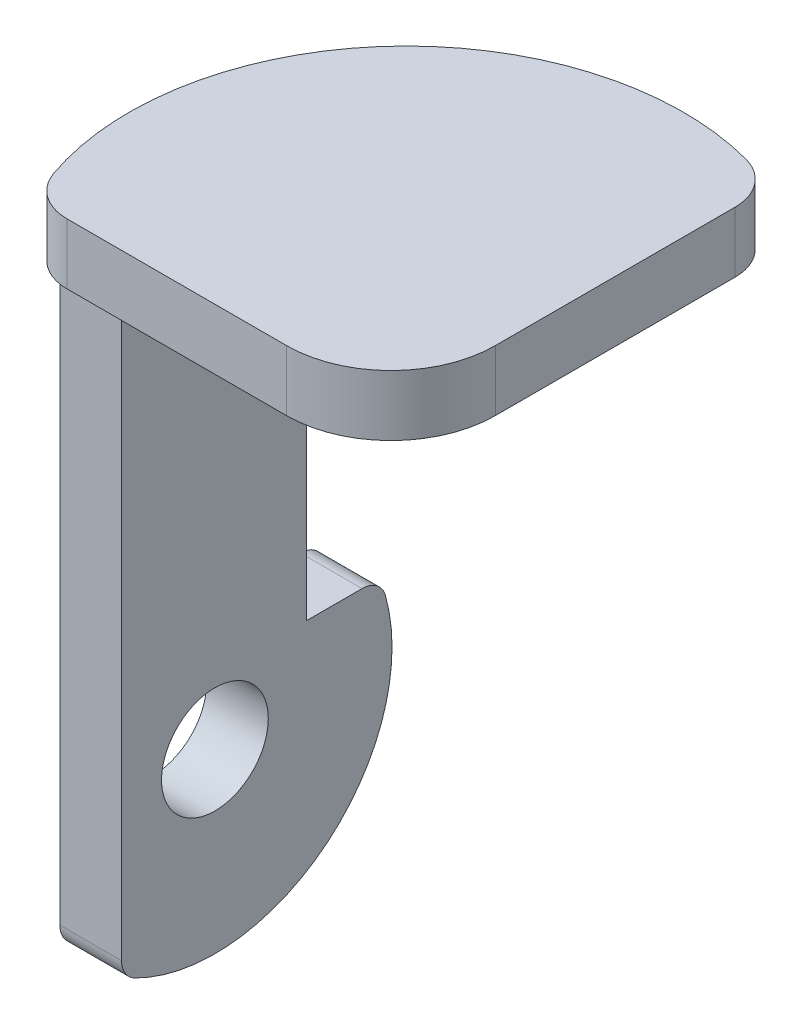
ISO-10303-21;
HEADER;
FILE_DESCRIPTION(('STEP AP214'),'2;1');
FILE_NAME('part.step','',(''),(''),'','','');
FILE_SCHEMA(('AUTOMOTIVE_DESIGN { 1 0 10303 214 1 1 1 1 }'));
ENDSEC;
DATA;
#1=APPLICATION_CONTEXT('core data for automotive mechanical design processes');
#2=APPLICATION_PROTOCOL_DEFINITION('international standard','automotive_design',2000,#1);
#3=PRODUCT_CONTEXT('',#1,'mechanical');
#4=PRODUCT('Part','Part','',(#3));
#5=PRODUCT_RELATED_PRODUCT_CATEGORY('part','',(#4));
#6=PRODUCT_DEFINITION_FORMATION('','',#4);
#7=PRODUCT_DEFINITION_CONTEXT('part definition',#1,'design');
#8=PRODUCT_DEFINITION('design','',#6,#7);
#9=PRODUCT_DEFINITION_SHAPE('','',#8);
#10=(LENGTH_UNIT() NAMED_UNIT(*) SI_UNIT(.MILLI.,.METRE.));
#11=(NAMED_UNIT(*) PLANE_ANGLE_UNIT() SI_UNIT($,.RADIAN.));
#12=(NAMED_UNIT(*) SI_UNIT($,.STERADIAN.) SOLID_ANGLE_UNIT());
#13=UNCERTAINTY_MEASURE_WITH_UNIT(LENGTH_MEASURE(1.E-05),#10,'distance_accuracy_value','');
#14=(GEOMETRIC_REPRESENTATION_CONTEXT(3) GLOBAL_UNCERTAINTY_ASSIGNED_CONTEXT((#13)) GLOBAL_UNIT_ASSIGNED_CONTEXT((#10,
#11,#12)) REPRESENTATION_CONTEXT('',''));
#15=CARTESIAN_POINT('',(0.,0.,0.));
#16=DIRECTION('',(0.,0.,1.));
#17=DIRECTION('',(1.,0.,0.));
#18=AXIS2_PLACEMENT_3D('',#15,#16,#17);
#19=CARTESIAN_POINT('',(-84.6,-198.317993617898,-38.0485313560635));
#20=DIRECTION('',(1.,0.,0.));
#21=DIRECTION('',(0.,0.,-1.));
#22=AXIS2_PLACEMENT_3D('',#19,#20,#21);
#23=PLANE('',#22);
#24=DIRECTION('',(0.,-1.,0.));
#25=VECTOR('',#24,1.);
#26=CARTESIAN_POINT('',(-84.6,-215.369552032089,61.1));
#27=LINE('',#26,#25);
#28=CARTESIAN_POINT('',(-84.6,-25.3695520320889,61.1));
#29=VERTEX_POINT('',#28);
#30=CARTESIAN_POINT('',(-84.6,-271.554514433073,61.1));
#31=VERTEX_POINT('',#30);
#32=EDGE_CURVE('E98',#29,#31,#27,.T.);
#33=ORIENTED_EDGE('',*,*,#32,.T.);
#34=CARTESIAN_POINT('',(-84.6,-271.554514433073,51.1));
#35=DIRECTION('',(1.,0.,0.));
#36=DIRECTION('',(0.,0.,1.));
#37=AXIS2_PLACEMENT_3D('',#34,#35,#36);
#38=CIRCLE('',#37,9.99999999999999);
#39=CARTESIAN_POINT('',(-84.6,-280.472762433229,55.6238095238095));
#40=VERTEX_POINT('',#39);
#41=EDGE_CURVE('E166',#31,#40,#38,.T.);
#42=ORIENTED_EDGE('',*,*,#41,.T.);
#43=CARTESIAN_POINT('',(-84.6,-215.369552032089,22.6));
#44=DIRECTION('',(1.,0.,0.));
#45=DIRECTION('',(0.,0.,-1.));
#46=AXIS2_PLACEMENT_3D('',#43,#44,#45);
#47=CIRCLE('',#46,73.);
#48=CARTESIAN_POINT('',(-84.6,-195.611397044217,-47.6752823649625));
#49=VERTEX_POINT('',#48);
#50=EDGE_CURVE('E158',#40,#49,#47,.T.);
#51=ORIENTED_EDGE('',*,*,#50,.T.);
#52=CARTESIAN_POINT('',(-84.6,-198.317993617898,-38.0485313560635));
#53=DIRECTION('',(1.,0.,0.));
#54=DIRECTION('',(0.,0.,-1.));
#55=AXIS2_PLACEMENT_3D('',#52,#53,#54);
#56=CIRCLE('',#55,9.99999999999999);
#57=CARTESIAN_POINT('',(-84.6,-188.317993617898,-38.0485313560635));
#58=VERTEX_POINT('',#57);
#59=EDGE_CURVE('E115',#49,#58,#56,.T.);
#60=ORIENTED_EDGE('',*,*,#59,.T.);
#61=DIRECTION('',(0.,0.,1.));
#62=VECTOR('',#61,1.);
#63=CARTESIAN_POINT('',(-84.6,-188.317993617898,-15.1));
#64=LINE('',#63,#62);
#65=CARTESIAN_POINT('',(-84.6,-188.317993617898,-15.1));
#66=VERTEX_POINT('',#65);
#67=EDGE_CURVE('E109',#58,#66,#64,.T.);
#68=ORIENTED_EDGE('',*,*,#67,.T.);
#69=DIRECTION('',(0.,1.,0.));
#70=VECTOR('',#69,1.);
#71=CARTESIAN_POINT('',(-84.6,-188.317993617898,-15.1));
#72=LINE('',#71,#70);
#73=CARTESIAN_POINT('',(-84.6,-25.3695520320889,-15.1));
#74=VERTEX_POINT('',#73);
#75=EDGE_CURVE('E113',#66,#74,#72,.T.);
#76=ORIENTED_EDGE('',*,*,#75,.T.);
#77=DIRECTION('',(0.,0.,1.));
#78=VECTOR('',#77,1.);
#79=CARTESIAN_POINT('',(-84.6,-25.3695520320889,-15.1));
#80=LINE('',#79,#78);
#81=EDGE_CURVE('E59',#74,#29,#80,.T.);
#82=ORIENTED_EDGE('',*,*,#81,.T.);
#83=EDGE_LOOP('',(#33,#42,#51,#60,#68,#76,#82));
#84=FACE_BOUND('',#83,.T.);
#85=CARTESIAN_POINT('',(-84.6,-215.369552032089,22.6));
#86=DIRECTION('',(1.,0.,0.));
#87=DIRECTION('',(0.,0.,-1.));
#88=AXIS2_PLACEMENT_3D('',#85,#86,#87);
#89=CIRCLE('',#88,22.);
#90=CARTESIAN_POINT('',(-84.6,-215.369552032089,0.600000000000024));
#91=VERTEX_POINT('',#90);
#92=EDGE_CURVE('E135',#91,#91,#89,.T.);
#93=ORIENTED_EDGE('',*,*,#92,.F.);
#94=EDGE_LOOP('',(#93));
#95=FACE_BOUND('',#94,.T.);
#96=ADVANCED_FACE('F42',(#84,#95),#23,.T.);
#97=CARTESIAN_POINT('',(-110.,-198.317993617898,-38.0485313560635));
#98=DIRECTION('',(1.,0.,0.));
#99=DIRECTION('',(0.,0.,-1.));
#100=AXIS2_PLACEMENT_3D('',#97,#98,#99);
#101=PLANE('',#100);
#102=DIRECTION('',(0.,-1.,0.));
#103=VECTOR('',#102,1.);
#104=CARTESIAN_POINT('',(-110.,-215.369552032089,61.1));
#105=LINE('',#104,#103);
#106=CARTESIAN_POINT('',(-110.,-25.3695520320889,61.1));
#107=VERTEX_POINT('',#106);
#108=CARTESIAN_POINT('',(-110.,-271.554514433073,61.1));
#109=VERTEX_POINT('',#108);
#110=EDGE_CURVE('E92',#107,#109,#105,.T.);
#111=ORIENTED_EDGE('',*,*,#110,.F.);
#112=DIRECTION('',(0.,0.,1.));
#113=VECTOR('',#112,1.);
#114=CARTESIAN_POINT('',(-110.,-25.3695520320889,-15.1));
#115=LINE('',#114,#113);
#116=CARTESIAN_POINT('',(-110.,-25.3695520320889,-15.1));
#117=VERTEX_POINT('',#116);
#118=EDGE_CURVE('E143',#117,#107,#115,.T.);
#119=ORIENTED_EDGE('',*,*,#118,.F.);
#120=DIRECTION('',(0.,1.,0.));
#121=VECTOR('',#120,1.);
#122=CARTESIAN_POINT('',(-110.,-188.317993617898,-15.1));
#123=LINE('',#122,#121);
#124=CARTESIAN_POINT('',(-110.,-188.317993617898,-15.1));
#125=VERTEX_POINT('',#124);
#126=EDGE_CURVE('E85',#125,#117,#123,.T.);
#127=ORIENTED_EDGE('',*,*,#126,.F.);
#128=DIRECTION('',(0.,0.,1.));
#129=VECTOR('',#128,1.);
#130=CARTESIAN_POINT('',(-110.,-188.317993617898,-15.1));
#131=LINE('',#130,#129);
#132=CARTESIAN_POINT('',(-110.,-188.317993617898,-38.0485313560635));
#133=VERTEX_POINT('',#132);
#134=EDGE_CURVE('E123',#133,#125,#131,.T.);
#135=ORIENTED_EDGE('',*,*,#134,.F.);
#136=CARTESIAN_POINT('',(-110.,-198.317993617898,-38.0485313560635));
#137=DIRECTION('',(1.,0.,0.));
#138=DIRECTION('',(0.,0.,-1.));
#139=AXIS2_PLACEMENT_3D('',#136,#137,#138);
#140=CIRCLE('',#139,9.99999999999999);
#141=CARTESIAN_POINT('',(-110.,-195.611397044217,-47.6752823649625));
#142=VERTEX_POINT('',#141);
#143=EDGE_CURVE('E139',#142,#133,#140,.T.);
#144=ORIENTED_EDGE('',*,*,#143,.F.);
#145=CARTESIAN_POINT('',(-110.,-215.369552032089,22.6));
#146=DIRECTION('',(1.,0.,0.));
#147=DIRECTION('',(0.,0.,-1.));
#148=AXIS2_PLACEMENT_3D('',#145,#146,#147);
#149=CIRCLE('',#148,73.);
#150=CARTESIAN_POINT('',(-110.,-280.472762433229,55.6238095238095));
#151=VERTEX_POINT('',#150);
#152=EDGE_CURVE('E137',#151,#142,#149,.T.);
#153=ORIENTED_EDGE('',*,*,#152,.F.);
#154=CARTESIAN_POINT('',(-110.,-271.554514433073,51.1));
#155=DIRECTION('',(1.,0.,0.));
#156=DIRECTION('',(0.,0.,1.));
#157=AXIS2_PLACEMENT_3D('',#154,#155,#156);
#158=CIRCLE('',#157,9.99999999999999);
#159=EDGE_CURVE('E134',#109,#151,#158,.T.);
#160=ORIENTED_EDGE('',*,*,#159,.F.);
#161=EDGE_LOOP('',(#111,#119,#127,#135,#144,#153,#160));
#162=FACE_BOUND('',#161,.T.);
#163=CARTESIAN_POINT('',(-110.,-215.369552032089,22.6));
#164=DIRECTION('',(1.,0.,0.));
#165=DIRECTION('',(0.,0.,-1.));
#166=AXIS2_PLACEMENT_3D('',#163,#164,#165);
#167=CIRCLE('',#166,22.);
#168=CARTESIAN_POINT('',(-110.,-215.369552032089,0.600000000000024));
#169=VERTEX_POINT('',#168);
#170=EDGE_CURVE('E171',#169,#169,#167,.T.);
#171=ORIENTED_EDGE('',*,*,#170,.T.);
#172=EDGE_LOOP('',(#171));
#173=FACE_BOUND('',#172,.T.);
#174=ADVANCED_FACE('F162',(#162,#173),#101,.F.);
#175=CARTESIAN_POINT('',(-84.6,-215.369552032089,61.1));
#176=DIRECTION('',(0.,0.,-1.));
#177=DIRECTION('',(-1.,0.,0.));
#178=AXIS2_PLACEMENT_3D('',#175,#176,#177);
#179=PLANE('',#178);
#180=ORIENTED_EDGE('',*,*,#110,.T.);
#181=DIRECTION('',(-1.,0.,0.));
#182=VECTOR('',#181,1.);
#183=CARTESIAN_POINT('',(-84.6,-271.554514433073,61.1));
#184=LINE('',#183,#182);
#185=EDGE_CURVE('E12',#31,#109,#184,.T.);
#186=ORIENTED_EDGE('',*,*,#185,.F.);
#187=ORIENTED_EDGE('',*,*,#32,.F.);
#188=DIRECTION('',(-1.,0.,0.));
#189=VECTOR('',#188,1.);
#190=CARTESIAN_POINT('',(-84.6,-25.3695520320889,61.1));
#191=LINE('',#190,#189);
#192=EDGE_CURVE('E129',#29,#107,#191,.T.);
#193=ORIENTED_EDGE('',*,*,#192,.T.);
#194=EDGE_LOOP('',(#180,#186,#187,#193));
#195=FACE_BOUND('',#194,.T.);
#196=ADVANCED_FACE('F44',(#195),#179,.F.);
#197=CARTESIAN_POINT('',(-84.6,-271.554514433073,51.1));
#198=DIRECTION('',(-1.,0.,0.));
#199=DIRECTION('',(0.,0.,1.));
#200=AXIS2_PLACEMENT_3D('',#197,#198,#199);
#201=CYLINDRICAL_SURFACE('',#200,9.99999999999999);
#202=ORIENTED_EDGE('',*,*,#159,.T.);
#203=DIRECTION('',(-1.,0.,0.));
#204=VECTOR('',#203,1.);
#205=CARTESIAN_POINT('',(-84.6,-280.472762433229,55.6238095238095));
#206=LINE('',#205,#204);
#207=EDGE_CURVE('E51',#40,#151,#206,.T.);
#208=ORIENTED_EDGE('',*,*,#207,.F.);
#209=ORIENTED_EDGE('',*,*,#41,.F.);
#210=ORIENTED_EDGE('',*,*,#185,.T.);
#211=EDGE_LOOP('',(#202,#208,#209,#210));
#212=FACE_BOUND('',#211,.T.);
#213=ADVANCED_FACE('F198',(#212),#201,.T.);
#214=CARTESIAN_POINT('',(-84.6,-215.369552032089,22.6));
#215=DIRECTION('',(-1.,0.,0.));
#216=DIRECTION('',(0.,0.,1.));
#217=AXIS2_PLACEMENT_3D('',#214,#215,#216);
#218=CYLINDRICAL_SURFACE('',#217,73.);
#219=ORIENTED_EDGE('',*,*,#152,.T.);
#220=DIRECTION('',(-1.,0.,0.));
#221=VECTOR('',#220,1.);
#222=CARTESIAN_POINT('',(-84.6,-195.611397044217,-47.6752823649625));
#223=LINE('',#222,#221);
#224=EDGE_CURVE('E149',#49,#142,#223,.T.);
#225=ORIENTED_EDGE('',*,*,#224,.F.);
#226=ORIENTED_EDGE('',*,*,#50,.F.);
#227=ORIENTED_EDGE('',*,*,#207,.T.);
#228=EDGE_LOOP('',(#219,#225,#226,#227));
#229=FACE_BOUND('',#228,.T.);
#230=ADVANCED_FACE('F156',(#229),#218,.T.);
#231=CARTESIAN_POINT('',(-84.6,-198.317993617898,-38.0485313560635));
#232=DIRECTION('',(-1.,0.,0.));
#233=DIRECTION('',(0.,0.,1.));
#234=AXIS2_PLACEMENT_3D('',#231,#232,#233);
#235=CYLINDRICAL_SURFACE('',#234,9.99999999999999);
#236=ORIENTED_EDGE('',*,*,#143,.T.);
#237=DIRECTION('',(-1.,0.,0.));
#238=VECTOR('',#237,1.);
#239=CARTESIAN_POINT('',(-84.6,-188.317993617898,-38.0485313560635));
#240=LINE('',#239,#238);
#241=EDGE_CURVE('E124',#58,#133,#240,.T.);
#242=ORIENTED_EDGE('',*,*,#241,.F.);
#243=ORIENTED_EDGE('',*,*,#59,.F.);
#244=ORIENTED_EDGE('',*,*,#224,.T.);
#245=EDGE_LOOP('',(#236,#242,#243,#244));
#246=FACE_BOUND('',#245,.T.);
#247=ADVANCED_FACE('F165',(#246),#235,.T.);
#248=CARTESIAN_POINT('',(-84.6,-188.317993617898,-15.1));
#249=DIRECTION('',(0.,-1.,0.));
#250=DIRECTION('',(0.,0.,-1.));
#251=AXIS2_PLACEMENT_3D('',#248,#249,#250);
#252=PLANE('',#251);
#253=ORIENTED_EDGE('',*,*,#134,.T.);
#254=DIRECTION('',(-1.,0.,0.));
#255=VECTOR('',#254,1.);
#256=CARTESIAN_POINT('',(-84.6,-188.317993617898,-15.1));
#257=LINE('',#256,#255);
#258=EDGE_CURVE('E120',#66,#125,#257,.T.);
#259=ORIENTED_EDGE('',*,*,#258,.F.);
#260=ORIENTED_EDGE('',*,*,#67,.F.);
#261=ORIENTED_EDGE('',*,*,#241,.T.);
#262=EDGE_LOOP('',(#253,#259,#260,#261));
#263=FACE_BOUND('',#262,.T.);
#264=ADVANCED_FACE('F121',(#263),#252,.F.);
#265=CARTESIAN_POINT('',(-84.6,-188.317993617898,-15.1));
#266=DIRECTION('',(0.,0.,1.));
#267=DIRECTION('',(1.,0.,0.));
#268=AXIS2_PLACEMENT_3D('',#265,#266,#267);
#269=PLANE('',#268);
#270=ORIENTED_EDGE('',*,*,#126,.T.);
#271=DIRECTION('',(-1.,0.,0.));
#272=VECTOR('',#271,1.);
#273=CARTESIAN_POINT('',(-84.6,-25.3695520320889,-15.1));
#274=LINE('',#273,#272);
#275=EDGE_CURVE('E125',#74,#117,#274,.T.);
#276=ORIENTED_EDGE('',*,*,#275,.F.);
#277=ORIENTED_EDGE('',*,*,#75,.F.);
#278=ORIENTED_EDGE('',*,*,#258,.T.);
#279=EDGE_LOOP('',(#270,#276,#277,#278));
#280=FACE_BOUND('',#279,.T.);
#281=ADVANCED_FACE('F127',(#280),#269,.F.);
#282=CARTESIAN_POINT('',(-84.6,-25.3695520320889,-15.1));
#283=DIRECTION('',(0.,-1.,0.));
#284=DIRECTION('',(0.,0.,-1.));
#285=AXIS2_PLACEMENT_3D('',#282,#283,#284);
#286=PLANE('',#285);
#287=ORIENTED_EDGE('',*,*,#118,.T.);
#288=ORIENTED_EDGE('',*,*,#192,.F.);
#289=ORIENTED_EDGE('',*,*,#81,.F.);
#290=ORIENTED_EDGE('',*,*,#275,.T.);
#291=EDGE_LOOP('',(#287,#288,#289,#290));
#292=FACE_BOUND('',#291,.T.);
#293=ADVANCED_FACE('F187',(#292),#286,.F.);
#294=CARTESIAN_POINT('',(-84.6,-215.369552032089,22.6));
#295=DIRECTION('',(-1.,0.,0.));
#296=DIRECTION('',(0.,0.,1.));
#297=AXIS2_PLACEMENT_3D('',#294,#295,#296);
#298=CYLINDRICAL_SURFACE('',#297,22.);
#299=ORIENTED_EDGE('',*,*,#92,.T.);
#300=EDGE_LOOP('',(#299));
#301=FACE_BOUND('',#300,.T.);
#302=ORIENTED_EDGE('',*,*,#170,.F.);
#303=EDGE_LOOP('',(#302));
#304=FACE_BOUND('',#303,.T.);
#305=ADVANCED_FACE('F177',(#301,#304),#298,.F.);
#306=CLOSED_SHELL('',(#96,#174,#196,#213,#230,#247,#264,#281,#293,#305));
#307=MANIFOLD_SOLID_BREP('B2',#306);
#308=CARTESIAN_POINT('',(1.45000000000002,-25.,36.1));
#309=DIRECTION('',(0.,1.,0.));
#310=DIRECTION('',(0.,0.,1.));
#311=AXIS2_PLACEMENT_3D('',#308,#309,#310);
#312=CYLINDRICAL_SURFACE('',#311,43.);
#313=CARTESIAN_POINT('',(1.45000000000002,0.,36.1));
#314=DIRECTION('',(0.,1.,0.));
#315=DIRECTION('',(0.,0.,1.));
#316=AXIS2_PLACEMENT_3D('',#313,#314,#315);
#317=CIRCLE('',#316,43.);
#318=CARTESIAN_POINT('',(1.45000000000002,0.,79.1));
#319=VERTEX_POINT('',#318);
#320=CARTESIAN_POINT('',(44.45,0.,36.1));
#321=VERTEX_POINT('',#320);
#322=EDGE_CURVE('E352',#319,#321,#317,.T.);
#323=ORIENTED_EDGE('',*,*,#322,.F.);
#324=DIRECTION('',(0.,1.,0.));
#325=VECTOR('',#324,1.);
#326=CARTESIAN_POINT('',(1.45000000000002,-25.,79.1));
#327=LINE('',#326,#325);
#328=CARTESIAN_POINT('',(1.45000000000002,-25.,79.1));
#329=VERTEX_POINT('',#328);
#330=EDGE_CURVE('E40',#329,#319,#327,.T.);
#331=ORIENTED_EDGE('',*,*,#330,.F.);
#332=CARTESIAN_POINT('',(1.45000000000002,-25.,36.1));
#333=DIRECTION('',(0.,1.,0.));
#334=DIRECTION('',(0.,0.,1.));
#335=AXIS2_PLACEMENT_3D('',#332,#333,#334);
#336=CIRCLE('',#335,43.);
#337=CARTESIAN_POINT('',(44.45,-25.,36.1));
#338=VERTEX_POINT('',#337);
#339=EDGE_CURVE('E366',#329,#338,#336,.T.);
#340=ORIENTED_EDGE('',*,*,#339,.T.);
#341=DIRECTION('',(0.,1.,0.));
#342=VECTOR('',#341,1.);
#343=CARTESIAN_POINT('',(44.45,-25.,36.1));
#344=LINE('',#343,#342);
#345=EDGE_CURVE('E270',#338,#321,#344,.T.);
#346=ORIENTED_EDGE('',*,*,#345,.T.);
#347=EDGE_LOOP('',(#323,#331,#340,#346));
#348=FACE_BOUND('',#347,.T.);
#349=ADVANCED_FACE('F267',(#348),#312,.T.);
#350=CARTESIAN_POINT('',(1.45000000000002,-25.,79.1));
#351=DIRECTION('',(0.,0.,1.));
#352=DIRECTION('',(1.,0.,0.));
#353=AXIS2_PLACEMENT_3D('',#350,#351,#352);
#354=PLANE('',#353);
#355=DIRECTION('',(1.,0.,0.));
#356=VECTOR('',#355,1.);
#357=CARTESIAN_POINT('',(1.45000000000002,0.,79.1));
#358=LINE('',#357,#356);
#359=CARTESIAN_POINT('',(-89.1282783408274,0.,79.1));
#360=VERTEX_POINT('',#359);
#361=EDGE_CURVE('E364',#360,#319,#358,.T.);
#362=ORIENTED_EDGE('',*,*,#361,.F.);
#363=DIRECTION('',(0.,1.,0.));
#364=VECTOR('',#363,1.);
#365=CARTESIAN_POINT('',(-89.1282783408274,-25.,79.1));
#366=LINE('',#365,#364);
#367=CARTESIAN_POINT('',(-89.1282783408274,-25.,79.1));
#368=VERTEX_POINT('',#367);
#369=EDGE_CURVE('E276',#368,#360,#366,.T.);
#370=ORIENTED_EDGE('',*,*,#369,.F.);
#371=DIRECTION('',(1.,0.,0.));
#372=VECTOR('',#371,1.);
#373=CARTESIAN_POINT('',(1.45000000000002,-25.,79.1));
#374=LINE('',#373,#372);
#375=EDGE_CURVE('E342',#368,#329,#374,.T.);
#376=ORIENTED_EDGE('',*,*,#375,.T.);
#377=ORIENTED_EDGE('',*,*,#330,.T.);
#378=EDGE_LOOP('',(#362,#370,#376,#377));
#379=FACE_BOUND('',#378,.T.);
#380=ADVANCED_FACE('F374',(#379),#354,.T.);
#381=CARTESIAN_POINT('',(-89.1282783408274,-25.,59.1));
#382=DIRECTION('',(0.,1.,0.));
#383=DIRECTION('',(0.,0.,1.));
#384=AXIS2_PLACEMENT_3D('',#381,#382,#383);
#385=CYLINDRICAL_SURFACE('',#384,20.);
#386=CARTESIAN_POINT('',(-89.1282783408274,0.,59.1));
#387=DIRECTION('',(0.,1.,0.));
#388=DIRECTION('',(0.,0.,-1.));
#389=AXIS2_PLACEMENT_3D('',#386,#387,#388);
#390=CIRCLE('',#389,20.);
#391=CARTESIAN_POINT('',(-108.031412665499,0.,65.6323435843054));
#392=VERTEX_POINT('',#391);
#393=EDGE_CURVE('E329',#392,#360,#390,.T.);
#394=ORIENTED_EDGE('',*,*,#393,.F.);
#395=DIRECTION('',(0.,1.,0.));
#396=VECTOR('',#395,1.);
#397=CARTESIAN_POINT('',(-108.031412665499,-25.,65.6323435843054));
#398=LINE('',#397,#396);
#399=CARTESIAN_POINT('',(-108.031412665499,-25.,65.6323435843054));
#400=VERTEX_POINT('',#399);
#401=EDGE_CURVE('E324',#400,#392,#398,.T.);
#402=ORIENTED_EDGE('',*,*,#401,.F.);
#403=CARTESIAN_POINT('',(-89.1282783408274,-25.,59.1));
#404=DIRECTION('',(0.,1.,0.));
#405=DIRECTION('',(0.,0.,-1.));
#406=AXIS2_PLACEMENT_3D('',#403,#404,#405);
#407=CIRCLE('',#406,20.);
#408=EDGE_CURVE('E327',#400,#368,#407,.T.);
#409=ORIENTED_EDGE('',*,*,#408,.T.);
#410=ORIENTED_EDGE('',*,*,#369,.T.);
#411=EDGE_LOOP('',(#394,#402,#409,#410));
#412=FACE_BOUND('',#411,.T.);
#413=ADVANCED_FACE('F326',(#412),#385,.T.);
#414=CARTESIAN_POINT('',(0.,-25.,28.3));
#415=DIRECTION('',(0.,1.,0.));
#416=DIRECTION('',(0.,0.,1.));
#417=AXIS2_PLACEMENT_3D('',#414,#415,#416);
#418=CYLINDRICAL_SURFACE('',#417,114.3);
#419=CARTESIAN_POINT('',(0.,0.,28.3));
#420=DIRECTION('',(0.,1.,0.));
#421=DIRECTION('',(0.,0.,1.));
#422=AXIS2_PLACEMENT_3D('',#419,#420,#421);
#423=CIRCLE('',#422,114.3);
#424=CARTESIAN_POINT('',(29.635577942736,0.,-82.0912248324115));
#425=VERTEX_POINT('',#424);
#426=EDGE_CURVE('E361',#425,#392,#423,.T.);
#427=ORIENTED_EDGE('',*,*,#426,.F.);
#428=DIRECTION('',(0.,1.,0.));
#429=VECTOR('',#428,1.);
#430=CARTESIAN_POINT('',(29.635577942736,-25.,-82.0912248324115));
#431=LINE('',#430,#429);
#432=CARTESIAN_POINT('',(29.635577942736,-25.,-82.0912248324115));
#433=VERTEX_POINT('',#432);
#434=EDGE_CURVE('E334',#433,#425,#431,.T.);
#435=ORIENTED_EDGE('',*,*,#434,.F.);
#436=CARTESIAN_POINT('',(0.,-25.,28.3));
#437=DIRECTION('',(0.,1.,0.));
#438=DIRECTION('',(0.,0.,1.));
#439=AXIS2_PLACEMENT_3D('',#436,#437,#438);
#440=CIRCLE('',#439,114.3);
#441=EDGE_CURVE('E340',#433,#400,#440,.T.);
#442=ORIENTED_EDGE('',*,*,#441,.T.);
#443=ORIENTED_EDGE('',*,*,#401,.T.);
#444=EDGE_LOOP('',(#427,#435,#442,#443));
#445=FACE_BOUND('',#444,.T.);
#446=ADVANCED_FACE('F344',(#445),#418,.T.);
#447=CARTESIAN_POINT('',(24.45,-25.,-62.7751749929694));
#448=DIRECTION('',(0.,1.,0.));
#449=DIRECTION('',(0.,0.,1.));
#450=AXIS2_PLACEMENT_3D('',#447,#448,#449);
#451=CYLINDRICAL_SURFACE('',#450,20.);
#452=CARTESIAN_POINT('',(24.45,0.,-62.7751749929694));
#453=DIRECTION('',(0.,1.,0.));
#454=DIRECTION('',(0.,0.,1.));
#455=AXIS2_PLACEMENT_3D('',#452,#453,#454);
#456=CIRCLE('',#455,20.);
#457=CARTESIAN_POINT('',(44.45,0.,-62.7751749929694));
#458=VERTEX_POINT('',#457);
#459=EDGE_CURVE('E358',#458,#425,#456,.T.);
#460=ORIENTED_EDGE('',*,*,#459,.F.);
#461=DIRECTION('',(0.,1.,0.));
#462=VECTOR('',#461,1.);
#463=CARTESIAN_POINT('',(44.45,-25.,-62.7751749929694));
#464=LINE('',#463,#462);
#465=CARTESIAN_POINT('',(44.45,-25.,-62.7751749929694));
#466=VERTEX_POINT('',#465);
#467=EDGE_CURVE('E369',#466,#458,#464,.T.);
#468=ORIENTED_EDGE('',*,*,#467,.F.);
#469=CARTESIAN_POINT('',(24.45,-25.,-62.7751749929694));
#470=DIRECTION('',(0.,1.,0.));
#471=DIRECTION('',(0.,0.,1.));
#472=AXIS2_PLACEMENT_3D('',#469,#470,#471);
#473=CIRCLE('',#472,20.);
#474=EDGE_CURVE('E345',#466,#433,#473,.T.);
#475=ORIENTED_EDGE('',*,*,#474,.T.);
#476=ORIENTED_EDGE('',*,*,#434,.T.);
#477=EDGE_LOOP('',(#460,#468,#475,#476));
#478=FACE_BOUND('',#477,.T.);
#479=ADVANCED_FACE('F387',(#478),#451,.T.);
#480=CARTESIAN_POINT('',(44.45,-25.,-62.7751749929694));
#481=DIRECTION('',(1.,0.,0.));
#482=DIRECTION('',(0.,0.,-1.));
#483=AXIS2_PLACEMENT_3D('',#480,#481,#482);
#484=PLANE('',#483);
#485=DIRECTION('',(0.,0.,-1.));
#486=VECTOR('',#485,1.);
#487=CARTESIAN_POINT('',(44.45,0.,-62.7751749929694));
#488=LINE('',#487,#486);
#489=EDGE_CURVE('E355',#321,#458,#488,.T.);
#490=ORIENTED_EDGE('',*,*,#489,.F.);
#491=ORIENTED_EDGE('',*,*,#345,.F.);
#492=DIRECTION('',(0.,0.,-1.));
#493=VECTOR('',#492,1.);
#494=CARTESIAN_POINT('',(44.45,-25.,-62.7751749929694));
#495=LINE('',#494,#493);
#496=EDGE_CURVE('E347',#338,#466,#495,.T.);
#497=ORIENTED_EDGE('',*,*,#496,.T.);
#498=ORIENTED_EDGE('',*,*,#467,.T.);
#499=EDGE_LOOP('',(#490,#491,#497,#498));
#500=FACE_BOUND('',#499,.T.);
#501=ADVANCED_FACE('F371',(#500),#484,.T.);
#502=CARTESIAN_POINT('',(1.45000000000002,-25.,36.1));
#503=DIRECTION('',(0.,1.,0.));
#504=DIRECTION('',(0.,0.,1.));
#505=AXIS2_PLACEMENT_3D('',#502,#503,#504);
#506=PLANE('',#505);
#507=ORIENTED_EDGE('',*,*,#339,.F.);
#508=ORIENTED_EDGE('',*,*,#375,.F.);
#509=ORIENTED_EDGE('',*,*,#408,.F.);
#510=ORIENTED_EDGE('',*,*,#441,.F.);
#511=ORIENTED_EDGE('',*,*,#474,.F.);
#512=ORIENTED_EDGE('',*,*,#496,.F.);
#513=EDGE_LOOP('',(#507,#508,#509,#510,#511,#512));
#514=FACE_BOUND('',#513,.T.);
#515=ADVANCED_FACE('F338',(#514),#506,.F.);
#516=CARTESIAN_POINT('',(1.45000000000002,0.,36.1));
#517=DIRECTION('',(0.,1.,0.));
#518=DIRECTION('',(0.,0.,1.));
#519=AXIS2_PLACEMENT_3D('',#516,#517,#518);
#520=PLANE('',#519);
#521=ORIENTED_EDGE('',*,*,#322,.T.);
#522=ORIENTED_EDGE('',*,*,#489,.T.);
#523=ORIENTED_EDGE('',*,*,#459,.T.);
#524=ORIENTED_EDGE('',*,*,#426,.T.);
#525=ORIENTED_EDGE('',*,*,#393,.T.);
#526=ORIENTED_EDGE('',*,*,#361,.T.);
#527=EDGE_LOOP('',(#521,#522,#523,#524,#525,#526));
#528=FACE_BOUND('',#527,.T.);
#529=ADVANCED_FACE('F373',(#528),#520,.T.);
#530=CLOSED_SHELL('',(#349,#380,#413,#446,#479,#501,#515,#529));
#531=MANIFOLD_SOLID_BREP('B6',#530);
#532=ADVANCED_BREP_SHAPE_REPRESENTATION('',(#18,#307,#531),#14);
#533=SHAPE_DEFINITION_REPRESENTATION(#9,#532);
ENDSEC;
END-ISO-10303-21;
